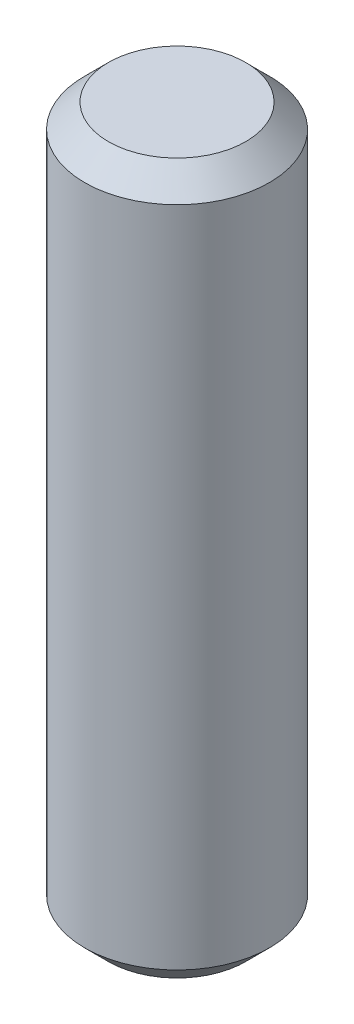
ISO-10303-21;
HEADER;
FILE_DESCRIPTION(('STEP AP214'),'2;1');
FILE_NAME('part.step','',(''),(''),'','','');
FILE_SCHEMA(('AUTOMOTIVE_DESIGN { 1 0 10303 214 1 1 1 1 }'));
ENDSEC;
DATA;
#1=APPLICATION_CONTEXT('core data for automotive mechanical design processes');
#2=APPLICATION_PROTOCOL_DEFINITION('international standard','automotive_design',2000,#1);
#3=PRODUCT_CONTEXT('',#1,'mechanical');
#4=PRODUCT('Part','Part','',(#3));
#5=PRODUCT_RELATED_PRODUCT_CATEGORY('part','',(#4));
#6=PRODUCT_DEFINITION_FORMATION('','',#4);
#7=PRODUCT_DEFINITION_CONTEXT('part definition',#1,'design');
#8=PRODUCT_DEFINITION('design','',#6,#7);
#9=PRODUCT_DEFINITION_SHAPE('','',#8);
#10=(LENGTH_UNIT() NAMED_UNIT(*) SI_UNIT(.MILLI.,.METRE.));
#11=(NAMED_UNIT(*) PLANE_ANGLE_UNIT() SI_UNIT($,.RADIAN.));
#12=(NAMED_UNIT(*) SI_UNIT($,.STERADIAN.) SOLID_ANGLE_UNIT());
#13=UNCERTAINTY_MEASURE_WITH_UNIT(LENGTH_MEASURE(1.E-05),#10,'distance_accuracy_value','');
#14=(GEOMETRIC_REPRESENTATION_CONTEXT(3) GLOBAL_UNCERTAINTY_ASSIGNED_CONTEXT((#13)) GLOBAL_UNIT_ASSIGNED_CONTEXT((#10,
#11,#12)) REPRESENTATION_CONTEXT('',''));
#15=CARTESIAN_POINT('',(0.,0.,0.));
#16=DIRECTION('',(0.,0.,1.));
#17=DIRECTION('',(1.,0.,0.));
#18=AXIS2_PLACEMENT_3D('',#15,#16,#17);
#19=CARTESIAN_POINT('',(0.,15.,0.));
#20=DIRECTION('',(0.,-1.,0.));
#21=DIRECTION('',(0.,0.,-1.));
#22=AXIS2_PLACEMENT_3D('',#19,#20,#21);
#23=CYLINDRICAL_SURFACE('',#22,3.9);
#24=CARTESIAN_POINT('',(0.,-14.,0.));
#25=DIRECTION('',(0.,1.,0.));
#26=DIRECTION('',(0.,0.,1.));
#27=AXIS2_PLACEMENT_3D('',#24,#25,#26);
#28=CIRCLE('',#27,3.9);
#29=CARTESIAN_POINT('',(0.,-14.,3.9));
#30=VERTEX_POINT('',#29);
#31=EDGE_CURVE('E47',#30,#30,#28,.T.);
#32=ORIENTED_EDGE('',*,*,#31,.T.);
#33=EDGE_LOOP('',(#32));
#34=FACE_BOUND('',#33,.T.);
#35=CARTESIAN_POINT('',(0.,14.,0.));
#36=DIRECTION('',(0.,1.,0.));
#37=DIRECTION('',(0.,0.,1.));
#38=AXIS2_PLACEMENT_3D('',#35,#36,#37);
#39=CIRCLE('',#38,3.9);
#40=CARTESIAN_POINT('',(0.,14.,3.9));
#41=VERTEX_POINT('',#40);
#42=EDGE_CURVE('E51',#41,#41,#39,.F.);
#43=ORIENTED_EDGE('',*,*,#42,.T.);
#44=EDGE_LOOP('',(#43));
#45=FACE_BOUND('',#44,.T.);
#46=ADVANCED_FACE('F35',(#34,#45),#23,.T.);
#47=CARTESIAN_POINT('',(0.,15.,0.));
#48=DIRECTION('',(0.,1.,0.));
#49=DIRECTION('',(0.,0.,1.));
#50=AXIS2_PLACEMENT_3D('',#47,#48,#49);
#51=PLANE('',#50);
#52=CARTESIAN_POINT('',(0.,15.,0.));
#53=DIRECTION('',(0.,1.,0.));
#54=DIRECTION('',(0.,0.,1.));
#55=AXIS2_PLACEMENT_3D('',#52,#53,#54);
#56=CIRCLE('',#55,2.89999999999999);
#57=CARTESIAN_POINT('',(0.,15.,2.89999999999999));
#58=VERTEX_POINT('',#57);
#59=EDGE_CURVE('E10',#58,#58,#56,.T.);
#60=ORIENTED_EDGE('',*,*,#59,.T.);
#61=EDGE_LOOP('',(#60));
#62=FACE_BOUND('',#61,.T.);
#63=ADVANCED_FACE('F67',(#62),#51,.T.);
#64=CARTESIAN_POINT('',(0.,-15.,0.));
#65=DIRECTION('',(0.,1.,0.));
#66=DIRECTION('',(0.,0.,1.));
#67=AXIS2_PLACEMENT_3D('',#64,#65,#66);
#68=PLANE('',#67);
#69=CARTESIAN_POINT('',(0.,-15.,0.));
#70=DIRECTION('',(0.,1.,0.));
#71=DIRECTION('',(0.,0.,1.));
#72=AXIS2_PLACEMENT_3D('',#69,#70,#71);
#73=CIRCLE('',#72,2.89999999999999);
#74=CARTESIAN_POINT('',(0.,-15.,2.89999999999999));
#75=VERTEX_POINT('',#74);
#76=EDGE_CURVE('E43',#75,#75,#73,.F.);
#77=ORIENTED_EDGE('',*,*,#76,.T.);
#78=EDGE_LOOP('',(#77));
#79=FACE_BOUND('',#78,.T.);
#80=ADVANCED_FACE('F64',(#79),#68,.F.);
#81=CARTESIAN_POINT('',(0.,-14.,0.));
#82=DIRECTION('',(0.,1.,0.));
#83=DIRECTION('',(0.,0.,1.));
#84=AXIS2_PLACEMENT_3D('',#81,#82,#83);
#85=CONICAL_SURFACE('',#84,3.9,0.785398163397451);
#86=ORIENTED_EDGE('',*,*,#76,.F.);
#87=EDGE_LOOP('',(#86));
#88=FACE_BOUND('',#87,.T.);
#89=ORIENTED_EDGE('',*,*,#31,.F.);
#90=EDGE_LOOP('',(#89));
#91=FACE_BOUND('',#90,.T.);
#92=ADVANCED_FACE('F60',(#88,#91),#85,.T.);
#93=CARTESIAN_POINT('',(0.,15.,0.));
#94=DIRECTION('',(0.,-1.,0.));
#95=DIRECTION('',(0.,0.,-1.));
#96=AXIS2_PLACEMENT_3D('',#93,#94,#95);
#97=CONICAL_SURFACE('',#96,2.89999999999999,0.785398163397445);
#98=ORIENTED_EDGE('',*,*,#42,.F.);
#99=EDGE_LOOP('',(#98));
#100=FACE_BOUND('',#99,.T.);
#101=ORIENTED_EDGE('',*,*,#59,.F.);
#102=EDGE_LOOP('',(#101));
#103=FACE_BOUND('',#102,.T.);
#104=ADVANCED_FACE('F38',(#100,#103),#97,.T.);
#105=CLOSED_SHELL('',(#46,#63,#80,#92,#104));
#106=MANIFOLD_SOLID_BREP('B2',#105);
#107=ADVANCED_BREP_SHAPE_REPRESENTATION('',(#18,#106),#14);
#108=SHAPE_DEFINITION_REPRESENTATION(#9,#107);
ENDSEC;
END-ISO-10303-21;
